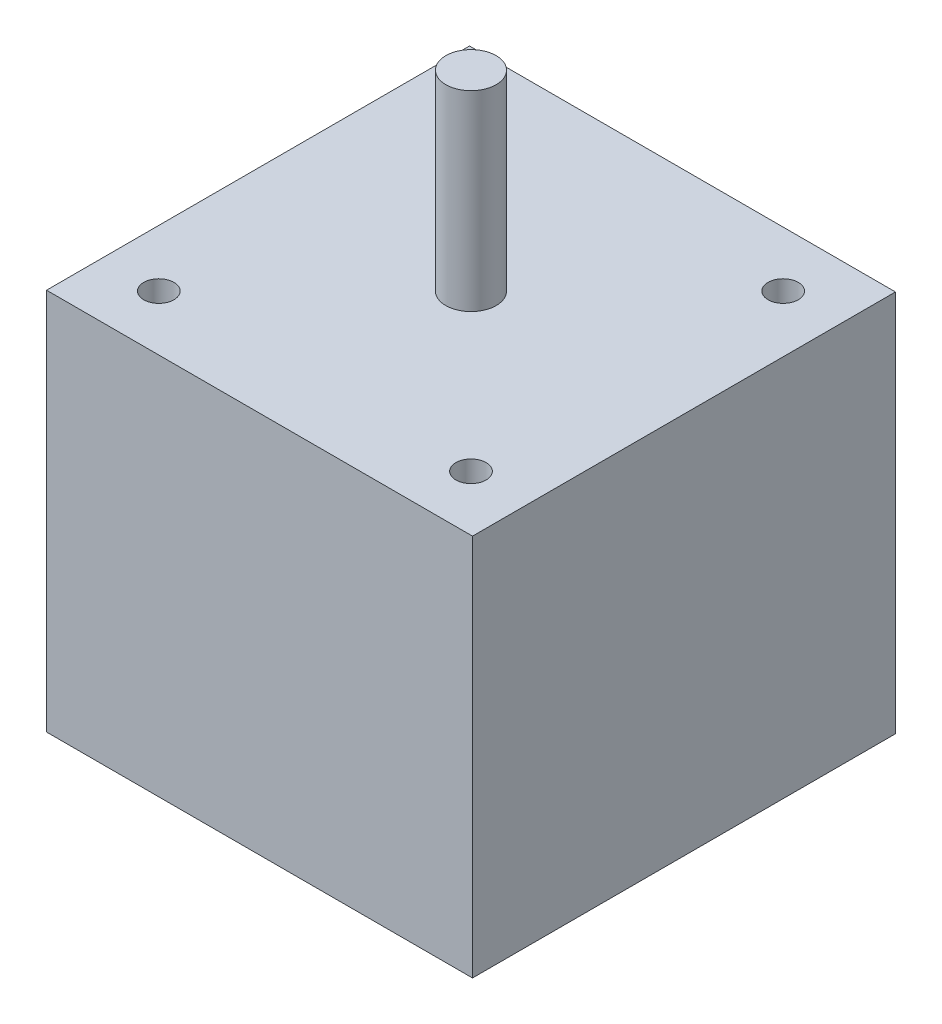
ISO-10303-21;
HEADER;
FILE_DESCRIPTION(('STEP AP214'),'2;1');
FILE_NAME('part.step','',(''),(''),'','','');
FILE_SCHEMA(('AUTOMOTIVE_DESIGN { 1 0 10303 214 1 1 1 1 }'));
ENDSEC;
DATA;
#1=APPLICATION_CONTEXT('core data for automotive mechanical design processes');
#2=APPLICATION_PROTOCOL_DEFINITION('international standard','automotive_design',2000,#1);
#3=PRODUCT_CONTEXT('',#1,'mechanical');
#4=PRODUCT('Part','Part','',(#3));
#5=PRODUCT_RELATED_PRODUCT_CATEGORY('part','',(#4));
#6=PRODUCT_DEFINITION_FORMATION('','',#4);
#7=PRODUCT_DEFINITION_CONTEXT('part definition',#1,'design');
#8=PRODUCT_DEFINITION('design','',#6,#7);
#9=PRODUCT_DEFINITION_SHAPE('','',#8);
#10=(LENGTH_UNIT() NAMED_UNIT(*) SI_UNIT(.MILLI.,.METRE.));
#11=(NAMED_UNIT(*) PLANE_ANGLE_UNIT() SI_UNIT($,.RADIAN.));
#12=(NAMED_UNIT(*) SI_UNIT($,.STERADIAN.) SOLID_ANGLE_UNIT());
#13=UNCERTAINTY_MEASURE_WITH_UNIT(LENGTH_MEASURE(1.E-05),#10,'distance_accuracy_value','');
#14=(GEOMETRIC_REPRESENTATION_CONTEXT(3) GLOBAL_UNCERTAINTY_ASSIGNED_CONTEXT((#13)) GLOBAL_UNIT_ASSIGNED_CONTEXT((#10,
#11,#12)) REPRESENTATION_CONTEXT('',''));
#15=CARTESIAN_POINT('',(0.,0.,0.));
#16=DIRECTION('',(0.,0.,1.));
#17=DIRECTION('',(1.,0.,0.));
#18=AXIS2_PLACEMENT_3D('',#15,#16,#17);
#19=CARTESIAN_POINT('',(21.1499999999999,38.,21.0000000000002));
#20=DIRECTION('',(-1.,0.,0.));
#21=DIRECTION('',(0.,0.,1.));
#22=AXIS2_PLACEMENT_3D('',#19,#20,#21);
#23=PLANE('',#22);
#24=DIRECTION('',(0.,0.,-1.));
#25=VECTOR('',#24,1.);
#26=CARTESIAN_POINT('',(21.1499999999999,0.,21.0000000000002));
#27=LINE('',#26,#25);
#28=CARTESIAN_POINT('',(21.1499999999999,0.,21.0000000000002));
#29=VERTEX_POINT('',#28);
#30=CARTESIAN_POINT('',(21.1499999999999,0.,-20.9999999999998));
#31=VERTEX_POINT('',#30);
#32=EDGE_CURVE('E110',#29,#31,#27,.T.);
#33=ORIENTED_EDGE('',*,*,#32,.T.);
#34=DIRECTION('',(0.,-1.,0.));
#35=VECTOR('',#34,1.);
#36=CARTESIAN_POINT('',(21.1499999999999,38.,-20.9999999999998));
#37=LINE('',#36,#35);
#38=CARTESIAN_POINT('',(21.1499999999999,38.,-20.9999999999998));
#39=VERTEX_POINT('',#38);
#40=EDGE_CURVE('E52',#39,#31,#37,.T.);
#41=ORIENTED_EDGE('',*,*,#40,.F.);
#42=DIRECTION('',(0.,0.,-1.));
#43=VECTOR('',#42,1.);
#44=CARTESIAN_POINT('',(21.1499999999999,38.,21.0000000000002));
#45=LINE('',#44,#43);
#46=CARTESIAN_POINT('',(21.1499999999999,38.,21.0000000000002));
#47=VERTEX_POINT('',#46);
#48=EDGE_CURVE('E96',#47,#39,#45,.T.);
#49=ORIENTED_EDGE('',*,*,#48,.F.);
#50=DIRECTION('',(0.,-1.,0.));
#51=VECTOR('',#50,1.);
#52=CARTESIAN_POINT('',(21.1499999999999,38.,21.0000000000002));
#53=LINE('',#52,#51);
#54=EDGE_CURVE('E106',#47,#29,#53,.T.);
#55=ORIENTED_EDGE('',*,*,#54,.T.);
#56=EDGE_LOOP('',(#33,#41,#49,#55));
#57=FACE_BOUND('',#56,.T.);
#58=ADVANCED_FACE('F44',(#57),#23,.F.);
#59=CARTESIAN_POINT('',(-21.1500000000001,38.,-20.9999999999998));
#60=DIRECTION('',(0.,0.,1.));
#61=DIRECTION('',(1.,0.,0.));
#62=AXIS2_PLACEMENT_3D('',#59,#60,#61);
#63=PLANE('',#62);
#64=DIRECTION('',(-1.,0.,0.));
#65=VECTOR('',#64,1.);
#66=CARTESIAN_POINT('',(-21.1500000000001,0.,-20.9999999999998));
#67=LINE('',#66,#65);
#68=CARTESIAN_POINT('',(-21.1500000000001,0.,-20.9999999999998));
#69=VERTEX_POINT('',#68);
#70=EDGE_CURVE('E101',#31,#69,#67,.T.);
#71=ORIENTED_EDGE('',*,*,#70,.T.);
#72=DIRECTION('',(0.,-1.,0.));
#73=VECTOR('',#72,1.);
#74=CARTESIAN_POINT('',(-21.1500000000001,38.,-20.9999999999998));
#75=LINE('',#74,#73);
#76=CARTESIAN_POINT('',(-21.1500000000001,38.,-20.9999999999998));
#77=VERTEX_POINT('',#76);
#78=EDGE_CURVE('E99',#77,#69,#75,.T.);
#79=ORIENTED_EDGE('',*,*,#78,.F.);
#80=DIRECTION('',(-1.,0.,0.));
#81=VECTOR('',#80,1.);
#82=CARTESIAN_POINT('',(-21.1500000000001,38.,-20.9999999999998));
#83=LINE('',#82,#81);
#84=EDGE_CURVE('E91',#39,#77,#83,.T.);
#85=ORIENTED_EDGE('',*,*,#84,.F.);
#86=ORIENTED_EDGE('',*,*,#40,.T.);
#87=EDGE_LOOP('',(#71,#79,#85,#86));
#88=FACE_BOUND('',#87,.T.);
#89=ADVANCED_FACE('F100',(#88),#63,.F.);
#90=CARTESIAN_POINT('',(-21.1500000000001,38.,21.0000000000002));
#91=DIRECTION('',(1.,0.,0.));
#92=DIRECTION('',(0.,0.,-1.));
#93=AXIS2_PLACEMENT_3D('',#90,#91,#92);
#94=PLANE('',#93);
#95=DIRECTION('',(0.,0.,1.));
#96=VECTOR('',#95,1.);
#97=CARTESIAN_POINT('',(-21.1500000000001,0.,21.0000000000002));
#98=LINE('',#97,#96);
#99=CARTESIAN_POINT('',(-21.1500000000001,0.,21.0000000000002));
#100=VERTEX_POINT('',#99);
#101=EDGE_CURVE('E77',#69,#100,#98,.T.);
#102=ORIENTED_EDGE('',*,*,#101,.T.);
#103=DIRECTION('',(0.,-1.,0.));
#104=VECTOR('',#103,1.);
#105=CARTESIAN_POINT('',(-21.1500000000001,38.,21.0000000000002));
#106=LINE('',#105,#104);
#107=CARTESIAN_POINT('',(-21.1500000000001,38.,21.0000000000002));
#108=VERTEX_POINT('',#107);
#109=EDGE_CURVE('E102',#108,#100,#106,.T.);
#110=ORIENTED_EDGE('',*,*,#109,.F.);
#111=DIRECTION('',(0.,0.,1.));
#112=VECTOR('',#111,1.);
#113=CARTESIAN_POINT('',(-21.1500000000001,38.,21.0000000000002));
#114=LINE('',#113,#112);
#115=EDGE_CURVE('E94',#77,#108,#114,.T.);
#116=ORIENTED_EDGE('',*,*,#115,.F.);
#117=ORIENTED_EDGE('',*,*,#78,.T.);
#118=EDGE_LOOP('',(#102,#110,#116,#117));
#119=FACE_BOUND('',#118,.T.);
#120=ADVANCED_FACE('F104',(#119),#94,.F.);
#121=CARTESIAN_POINT('',(-21.1500000000001,38.,21.0000000000002));
#122=DIRECTION('',(0.,0.,-1.));
#123=DIRECTION('',(-1.,0.,0.));
#124=AXIS2_PLACEMENT_3D('',#121,#122,#123);
#125=PLANE('',#124);
#126=DIRECTION('',(1.,0.,0.));
#127=VECTOR('',#126,1.);
#128=CARTESIAN_POINT('',(-21.1500000000001,0.,21.0000000000002));
#129=LINE('',#128,#127);
#130=EDGE_CURVE('E83',#100,#29,#129,.T.);
#131=ORIENTED_EDGE('',*,*,#130,.T.);
#132=ORIENTED_EDGE('',*,*,#54,.F.);
#133=DIRECTION('',(1.,0.,0.));
#134=VECTOR('',#133,1.);
#135=CARTESIAN_POINT('',(-21.1500000000001,38.,21.0000000000002));
#136=LINE('',#135,#134);
#137=EDGE_CURVE('E60',#108,#47,#136,.T.);
#138=ORIENTED_EDGE('',*,*,#137,.F.);
#139=ORIENTED_EDGE('',*,*,#109,.T.);
#140=EDGE_LOOP('',(#131,#132,#138,#139));
#141=FACE_BOUND('',#140,.T.);
#142=ADVANCED_FACE('F132',(#141),#125,.F.);
#143=CARTESIAN_POINT('',(0.,38.,0.));
#144=DIRECTION('',(0.,-1.,0.));
#145=DIRECTION('',(0.,0.,-1.));
#146=AXIS2_PLACEMENT_3D('',#143,#144,#145);
#147=PLANE('',#146);
#148=CARTESIAN_POINT('',(-15.5,38.,15.5));
#149=DIRECTION('',(0.,1.,0.));
#150=DIRECTION('',(0.,0.,1.));
#151=AXIS2_PLACEMENT_3D('',#148,#149,#150);
#152=CIRCLE('',#151,1.5);
#153=CARTESIAN_POINT('',(-15.5,38.,17.));
#154=VERTEX_POINT('',#153);
#155=EDGE_CURVE('E258',#154,#154,#152,.T.);
#156=ORIENTED_EDGE('',*,*,#155,.F.);
#157=EDGE_LOOP('',(#156));
#158=FACE_BOUND('',#157,.T.);
#159=CARTESIAN_POINT('',(15.5,38.,15.5));
#160=DIRECTION('',(0.,1.,0.));
#161=DIRECTION('',(0.,0.,1.));
#162=AXIS2_PLACEMENT_3D('',#159,#160,#161);
#163=CIRCLE('',#162,1.5);
#164=CARTESIAN_POINT('',(15.5,38.,17.));
#165=VERTEX_POINT('',#164);
#166=EDGE_CURVE('E263',#165,#165,#163,.T.);
#167=ORIENTED_EDGE('',*,*,#166,.F.);
#168=EDGE_LOOP('',(#167));
#169=FACE_BOUND('',#168,.T.);
#170=CARTESIAN_POINT('',(15.5,38.,-15.5));
#171=DIRECTION('',(0.,1.,0.));
#172=DIRECTION('',(0.,0.,1.));
#173=AXIS2_PLACEMENT_3D('',#170,#171,#172);
#174=CIRCLE('',#173,1.5);
#175=CARTESIAN_POINT('',(15.5,38.,-14.));
#176=VERTEX_POINT('',#175);
#177=EDGE_CURVE('E269',#176,#176,#174,.T.);
#178=ORIENTED_EDGE('',*,*,#177,.F.);
#179=EDGE_LOOP('',(#178));
#180=FACE_BOUND('',#179,.T.);
#181=CARTESIAN_POINT('',(-15.5,38.,-15.5));
#182=DIRECTION('',(0.,1.,0.));
#183=DIRECTION('',(0.,0.,1.));
#184=AXIS2_PLACEMENT_3D('',#181,#182,#183);
#185=CIRCLE('',#184,1.5);
#186=CARTESIAN_POINT('',(-15.5,38.,-14.));
#187=VERTEX_POINT('',#186);
#188=EDGE_CURVE('E252',#187,#187,#185,.T.);
#189=ORIENTED_EDGE('',*,*,#188,.F.);
#190=EDGE_LOOP('',(#189));
#191=FACE_BOUND('',#190,.T.);
#192=CARTESIAN_POINT('',(0.,38.,0.));
#193=DIRECTION('',(0.,-1.,0.));
#194=DIRECTION('',(0.,0.,-1.));
#195=AXIS2_PLACEMENT_3D('',#192,#193,#194);
#196=CIRCLE('',#195,2.5);
#197=CARTESIAN_POINT('',(0.,38.,-2.5));
#198=VERTEX_POINT('',#197);
#199=EDGE_CURVE('E13',#198,#198,#196,.F.);
#200=ORIENTED_EDGE('',*,*,#199,.F.);
#201=EDGE_LOOP('',(#200));
#202=FACE_BOUND('',#201,.T.);
#203=ORIENTED_EDGE('',*,*,#48,.T.);
#204=ORIENTED_EDGE('',*,*,#84,.T.);
#205=ORIENTED_EDGE('',*,*,#115,.T.);
#206=ORIENTED_EDGE('',*,*,#137,.T.);
#207=EDGE_LOOP('',(#203,#204,#205,#206));
#208=FACE_BOUND('',#207,.T.);
#209=ADVANCED_FACE('F92',(#158,#169,#180,#191,#202,#208),#147,.F.);
#210=CARTESIAN_POINT('',(0.,0.,0.));
#211=DIRECTION('',(0.,-1.,0.));
#212=DIRECTION('',(0.,0.,-1.));
#213=AXIS2_PLACEMENT_3D('',#210,#211,#212);
#214=PLANE('',#213);
#215=ORIENTED_EDGE('',*,*,#32,.F.);
#216=ORIENTED_EDGE('',*,*,#130,.F.);
#217=ORIENTED_EDGE('',*,*,#101,.F.);
#218=ORIENTED_EDGE('',*,*,#70,.F.);
#219=EDGE_LOOP('',(#215,#216,#217,#218));
#220=FACE_BOUND('',#219,.T.);
#221=ADVANCED_FACE('F121',(#220),#214,.T.);
#222=CARTESIAN_POINT('',(0.,57.,0.));
#223=DIRECTION('',(0.,-1.,0.));
#224=DIRECTION('',(0.,0.,-1.));
#225=AXIS2_PLACEMENT_3D('',#222,#223,#224);
#226=CYLINDRICAL_SURFACE('',#225,2.5);
#227=CARTESIAN_POINT('',(0.,57.,0.));
#228=DIRECTION('',(0.,1.,0.));
#229=DIRECTION('',(0.,0.,1.));
#230=AXIS2_PLACEMENT_3D('',#227,#228,#229);
#231=CIRCLE('',#230,2.5);
#232=CARTESIAN_POINT('',(0.,57.,2.5));
#233=VERTEX_POINT('',#232);
#234=EDGE_CURVE('E113',#233,#233,#231,.T.);
#235=ORIENTED_EDGE('',*,*,#234,.F.);
#236=EDGE_LOOP('',(#235));
#237=FACE_BOUND('',#236,.T.);
#238=ORIENTED_EDGE('',*,*,#199,.T.);
#239=EDGE_LOOP('',(#238));
#240=FACE_BOUND('',#239,.T.);
#241=ADVANCED_FACE('F123',(#237,#240),#226,.T.);
#242=CARTESIAN_POINT('',(0.,57.,0.));
#243=DIRECTION('',(0.,1.,0.));
#244=DIRECTION('',(0.,0.,1.));
#245=AXIS2_PLACEMENT_3D('',#242,#243,#244);
#246=PLANE('',#245);
#247=ORIENTED_EDGE('',*,*,#234,.T.);
#248=EDGE_LOOP('',(#247));
#249=FACE_BOUND('',#248,.T.);
#250=ADVANCED_FACE('F129',(#249),#246,.T.);
#251=CARTESIAN_POINT('',(-15.5,33.5,-15.5));
#252=DIRECTION('',(0.,1.,0.));
#253=DIRECTION('',(0.,0.,1.));
#254=AXIS2_PLACEMENT_3D('',#251,#252,#253);
#255=CYLINDRICAL_SURFACE('',#254,1.5);
#256=CARTESIAN_POINT('',(-15.5,33.5,-15.5));
#257=DIRECTION('',(0.,1.,0.));
#258=DIRECTION('',(0.,0.,1.));
#259=AXIS2_PLACEMENT_3D('',#256,#257,#258);
#260=CIRCLE('',#259,1.5);
#261=CARTESIAN_POINT('',(-15.5,33.5,-14.));
#262=VERTEX_POINT('',#261);
#263=EDGE_CURVE('E249',#262,#262,#260,.T.);
#264=ORIENTED_EDGE('',*,*,#263,.F.);
#265=EDGE_LOOP('',(#264));
#266=FACE_BOUND('',#265,.T.);
#267=ORIENTED_EDGE('',*,*,#188,.T.);
#268=EDGE_LOOP('',(#267));
#269=FACE_BOUND('',#268,.T.);
#270=ADVANCED_FACE('F164',(#266,#269),#255,.F.);
#271=CARTESIAN_POINT('',(-15.5,33.5,-15.5));
#272=DIRECTION('',(0.,1.,0.));
#273=DIRECTION('',(0.,0.,1.));
#274=AXIS2_PLACEMENT_3D('',#271,#272,#273);
#275=PLANE('',#274);
#276=ORIENTED_EDGE('',*,*,#263,.T.);
#277=EDGE_LOOP('',(#276));
#278=FACE_BOUND('',#277,.T.);
#279=ADVANCED_FACE('F169',(#278),#275,.T.);
#280=CARTESIAN_POINT('',(15.5,33.5,-15.5));
#281=DIRECTION('',(0.,1.,0.));
#282=DIRECTION('',(0.,0.,1.));
#283=AXIS2_PLACEMENT_3D('',#280,#281,#282);
#284=CYLINDRICAL_SURFACE('',#283,1.5);
#285=CARTESIAN_POINT('',(15.5,33.5,-15.5));
#286=DIRECTION('',(0.,1.,0.));
#287=DIRECTION('',(0.,0.,1.));
#288=AXIS2_PLACEMENT_3D('',#285,#286,#287);
#289=CIRCLE('',#288,1.5);
#290=CARTESIAN_POINT('',(15.5,33.5,-14.));
#291=VERTEX_POINT('',#290);
#292=EDGE_CURVE('E256',#291,#291,#289,.T.);
#293=ORIENTED_EDGE('',*,*,#292,.F.);
#294=EDGE_LOOP('',(#293));
#295=FACE_BOUND('',#294,.T.);
#296=ORIENTED_EDGE('',*,*,#177,.T.);
#297=EDGE_LOOP('',(#296));
#298=FACE_BOUND('',#297,.T.);
#299=ADVANCED_FACE('F179',(#295,#298),#284,.F.);
#300=CARTESIAN_POINT('',(15.5,33.5,-15.5));
#301=DIRECTION('',(0.,1.,0.));
#302=DIRECTION('',(0.,0.,1.));
#303=AXIS2_PLACEMENT_3D('',#300,#301,#302);
#304=PLANE('',#303);
#305=ORIENTED_EDGE('',*,*,#292,.T.);
#306=EDGE_LOOP('',(#305));
#307=FACE_BOUND('',#306,.T.);
#308=ADVANCED_FACE('F189',(#307),#304,.T.);
#309=CARTESIAN_POINT('',(15.5,33.5,15.5));
#310=DIRECTION('',(0.,1.,0.));
#311=DIRECTION('',(0.,0.,1.));
#312=AXIS2_PLACEMENT_3D('',#309,#310,#311);
#313=CYLINDRICAL_SURFACE('',#312,1.5);
#314=CARTESIAN_POINT('',(15.5,33.5,15.5));
#315=DIRECTION('',(0.,1.,0.));
#316=DIRECTION('',(0.,0.,1.));
#317=AXIS2_PLACEMENT_3D('',#314,#315,#316);
#318=CIRCLE('',#317,1.5);
#319=CARTESIAN_POINT('',(15.5,33.5,17.));
#320=VERTEX_POINT('',#319);
#321=EDGE_CURVE('E266',#320,#320,#318,.T.);
#322=ORIENTED_EDGE('',*,*,#321,.F.);
#323=EDGE_LOOP('',(#322));
#324=FACE_BOUND('',#323,.T.);
#325=ORIENTED_EDGE('',*,*,#166,.T.);
#326=EDGE_LOOP('',(#325));
#327=FACE_BOUND('',#326,.T.);
#328=ADVANCED_FACE('F199',(#324,#327),#313,.F.);
#329=CARTESIAN_POINT('',(15.5,33.5,15.5));
#330=DIRECTION('',(0.,1.,0.));
#331=DIRECTION('',(0.,0.,1.));
#332=AXIS2_PLACEMENT_3D('',#329,#330,#331);
#333=PLANE('',#332);
#334=ORIENTED_EDGE('',*,*,#321,.T.);
#335=EDGE_LOOP('',(#334));
#336=FACE_BOUND('',#335,.T.);
#337=ADVANCED_FACE('F209',(#336),#333,.T.);
#338=CARTESIAN_POINT('',(-15.5,33.5,15.5));
#339=DIRECTION('',(0.,1.,0.));
#340=DIRECTION('',(0.,0.,1.));
#341=AXIS2_PLACEMENT_3D('',#338,#339,#340);
#342=CYLINDRICAL_SURFACE('',#341,1.5);
#343=CARTESIAN_POINT('',(-15.5,33.5,15.5));
#344=DIRECTION('',(0.,1.,0.));
#345=DIRECTION('',(0.,0.,1.));
#346=AXIS2_PLACEMENT_3D('',#343,#344,#345);
#347=CIRCLE('',#346,1.5);
#348=CARTESIAN_POINT('',(-15.5,33.5,17.));
#349=VERTEX_POINT('',#348);
#350=EDGE_CURVE('E261',#349,#349,#347,.T.);
#351=ORIENTED_EDGE('',*,*,#350,.F.);
#352=EDGE_LOOP('',(#351));
#353=FACE_BOUND('',#352,.T.);
#354=ORIENTED_EDGE('',*,*,#155,.T.);
#355=EDGE_LOOP('',(#354));
#356=FACE_BOUND('',#355,.T.);
#357=ADVANCED_FACE('F219',(#353,#356),#342,.F.);
#358=CARTESIAN_POINT('',(-15.5,33.5,15.5));
#359=DIRECTION('',(0.,1.,0.));
#360=DIRECTION('',(0.,0.,1.));
#361=AXIS2_PLACEMENT_3D('',#358,#359,#360);
#362=PLANE('',#361);
#363=ORIENTED_EDGE('',*,*,#350,.T.);
#364=EDGE_LOOP('',(#363));
#365=FACE_BOUND('',#364,.T.);
#366=ADVANCED_FACE('F229',(#365),#362,.T.);
#367=CLOSED_SHELL('',(#58,#89,#120,#142,#209,#221,#241,#250,#270,#279,#299,#308,#328,#337,#357,#366));
#368=MANIFOLD_SOLID_BREP('B2',#367);
#369=ADVANCED_BREP_SHAPE_REPRESENTATION('',(#18,#368),#14);
#370=SHAPE_DEFINITION_REPRESENTATION(#9,#369);
ENDSEC;
END-ISO-10303-21;
